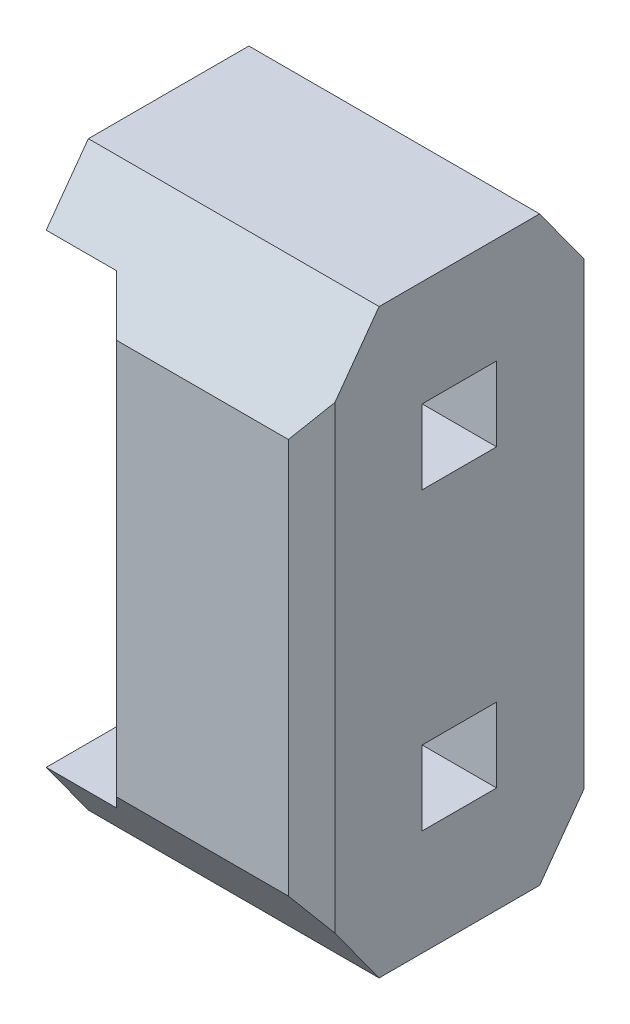
ISO-10303-21;
HEADER;
FILE_DESCRIPTION(('STEP AP214'),'2;1');
FILE_NAME('part.step','',(''),(''),'','','');
FILE_SCHEMA(('AUTOMOTIVE_DESIGN { 1 0 10303 214 1 1 1 1 }'));
ENDSEC;
DATA;
#1=APPLICATION_CONTEXT('core data for automotive mechanical design processes');
#2=APPLICATION_PROTOCOL_DEFINITION('international standard','automotive_design',2000,#1);
#3=PRODUCT_CONTEXT('',#1,'mechanical');
#4=PRODUCT('Part','Part','',(#3));
#5=PRODUCT_RELATED_PRODUCT_CATEGORY('part','',(#4));
#6=PRODUCT_DEFINITION_FORMATION('','',#4);
#7=PRODUCT_DEFINITION_CONTEXT('part definition',#1,'design');
#8=PRODUCT_DEFINITION('design','',#6,#7);
#9=PRODUCT_DEFINITION_SHAPE('','',#8);
#10=(LENGTH_UNIT() NAMED_UNIT(*) SI_UNIT(.MILLI.,.METRE.));
#11=(NAMED_UNIT(*) PLANE_ANGLE_UNIT() SI_UNIT($,.RADIAN.));
#12=(NAMED_UNIT(*) SI_UNIT($,.STERADIAN.) SOLID_ANGLE_UNIT());
#13=UNCERTAINTY_MEASURE_WITH_UNIT(LENGTH_MEASURE(1.E-05),#10,'distance_accuracy_value','');
#14=(GEOMETRIC_REPRESENTATION_CONTEXT(3) GLOBAL_UNCERTAINTY_ASSIGNED_CONTEXT((#13)) GLOBAL_UNIT_ASSIGNED_CONTEXT((#10,
#11,#12)) REPRESENTATION_CONTEXT('',''));
#15=CARTESIAN_POINT('',(0.,0.,0.));
#16=DIRECTION('',(0.,0.,1.));
#17=DIRECTION('',(1.,0.,0.));
#18=AXIS2_PLACEMENT_3D('',#15,#16,#17);
#19=CARTESIAN_POINT('',(1.25,4.6,-10.45));
#20=DIRECTION('',(0.,0.586967571460905,0.809610443394407));
#21=DIRECTION('',(0.,-0.809610443394407,0.586967571460905));
#22=AXIS2_PLACEMENT_3D('',#19,#20,#21);
#23=PLANE('',#22);
#24=DIRECTION('',(1.,0.,0.));
#25=VECTOR('',#24,1.);
#26=CARTESIAN_POINT('',(1.25,4.5,-10.3775));
#27=LINE('',#26,#25);
#28=CARTESIAN_POINT('',(0.,4.5,-10.3775));
#29=VERTEX_POINT('',#28);
#30=CARTESIAN_POINT('',(0.602500000000325,4.5,-10.3775000000001));
#31=VERTEX_POINT('',#30);
#32=EDGE_CURVE('E199',#29,#31,#27,.T.);
#33=ORIENTED_EDGE('',*,*,#32,.T.);
#34=DIRECTION('',(0.506207656348696,-0.698217457033982,0.506207656349605));
#35=VECTOR('',#34,1.);
#36=CARTESIAN_POINT('',(0.6025000000002,4.5,-10.3775));
#37=LINE('',#36,#35);
#38=CARTESIAN_POINT('',(0.819999999999671,4.2,-10.1599999999999));
#39=VERTEX_POINT('',#38);
#40=EDGE_CURVE('E197',#31,#39,#37,.T.);
#41=ORIENTED_EDGE('',*,*,#40,.T.);
#42=DIRECTION('',(1.,0.,0.));
#43=VECTOR('',#42,1.);
#44=CARTESIAN_POINT('',(1.25,4.19999999999999,-10.16));
#45=LINE('',#44,#43);
#46=CARTESIAN_POINT('',(2.30000000000012,4.2,-10.1599999999999));
#47=VERTEX_POINT('',#46);
#48=EDGE_CURVE('E20',#39,#47,#45,.T.);
#49=ORIENTED_EDGE('',*,*,#48,.T.);
#50=DIRECTION('',(0.506207656348957,0.698217457033858,-0.506207656349515));
#51=VECTOR('',#50,1.);
#52=CARTESIAN_POINT('',(2.3,4.19999999999999,-10.16));
#53=LINE('',#52,#51);
#54=CARTESIAN_POINT('',(2.49999999999988,4.47586206896591,-10.3600000000002));
#55=VERTEX_POINT('',#54);
#56=EDGE_CURVE('E181',#47,#55,#53,.T.);
#57=ORIENTED_EDGE('',*,*,#56,.T.);
#58=DIRECTION('',(0.,-0.809610443394407,0.586967571460905));
#59=VECTOR('',#58,1.);
#60=CARTESIAN_POINT('',(2.5,4.6,-10.45));
#61=LINE('',#60,#59);
#62=CARTESIAN_POINT('',(2.5,5.00000000000001,-10.74));
#63=VERTEX_POINT('',#62);
#64=EDGE_CURVE('E188',#55,#63,#61,.F.);
#65=ORIENTED_EDGE('',*,*,#64,.T.);
#66=DIRECTION('',(1.,0.,0.));
#67=VECTOR('',#66,1.);
#68=CARTESIAN_POINT('',(1.25,5.,-10.74));
#69=LINE('',#68,#67);
#70=CARTESIAN_POINT('',(0.,5.00000000000001,-10.74));
#71=VERTEX_POINT('',#70);
#72=EDGE_CURVE('E215',#71,#63,#69,.T.);
#73=ORIENTED_EDGE('',*,*,#72,.F.);
#74=DIRECTION('',(0.,-0.809610443394407,0.586967571460905));
#75=VECTOR('',#74,1.);
#76=CARTESIAN_POINT('',(0.,4.6,-10.45));
#77=LINE('',#76,#75);
#78=EDGE_CURVE('E207',#71,#29,#77,.T.);
#79=ORIENTED_EDGE('',*,*,#78,.T.);
#80=EDGE_LOOP('',(#33,#41,#49,#57,#65,#73,#79));
#81=FACE_BOUND('',#80,.T.);
#82=ADVANCED_FACE('F17',(#81),#23,.T.);
#83=CARTESIAN_POINT('',(1.25,4.6,-12.41));
#84=DIRECTION('',(0.,-0.586967571460905,0.809610443394407));
#85=DIRECTION('',(0.,-0.809610443394407,-0.586967571460905));
#86=AXIS2_PLACEMENT_3D('',#83,#84,#85);
#87=PLANE('',#86);
#88=DIRECTION('',(0.,-0.809610443394407,-0.586967571460905));
#89=VECTOR('',#88,1.);
#90=CARTESIAN_POINT('',(0.,4.6,-12.41));
#91=LINE('',#90,#89);
#92=CARTESIAN_POINT('',(0.,5.00000000000001,-12.12));
#93=VERTEX_POINT('',#92);
#94=CARTESIAN_POINT('',(0.,4.5,-12.4825));
#95=VERTEX_POINT('',#94);
#96=EDGE_CURVE('E263',#93,#95,#91,.T.);
#97=ORIENTED_EDGE('',*,*,#96,.F.);
#98=DIRECTION('',(1.,0.,0.));
#99=VECTOR('',#98,1.);
#100=CARTESIAN_POINT('',(1.25,5.,-12.12));
#101=LINE('',#100,#99);
#102=CARTESIAN_POINT('',(2.5,5.,-12.12));
#103=VERTEX_POINT('',#102);
#104=EDGE_CURVE('E227',#103,#93,#101,.F.);
#105=ORIENTED_EDGE('',*,*,#104,.F.);
#106=DIRECTION('',(0.,-0.809610443394407,-0.586967571460905));
#107=VECTOR('',#106,1.);
#108=CARTESIAN_POINT('',(2.5,4.6,-12.41));
#109=LINE('',#108,#107);
#110=CARTESIAN_POINT('',(2.49999999999988,4.47586206896591,-12.4999999999998));
#111=VERTEX_POINT('',#110);
#112=EDGE_CURVE('E223',#111,#103,#109,.F.);
#113=ORIENTED_EDGE('',*,*,#112,.F.);
#114=DIRECTION('',(0.506207656348957,0.698217457033858,0.506207656349515));
#115=VECTOR('',#114,1.);
#116=CARTESIAN_POINT('',(2.3,4.19999999999999,-12.7));
#117=LINE('',#116,#115);
#118=CARTESIAN_POINT('',(2.30000000000012,4.2,-12.7000000000001));
#119=VERTEX_POINT('',#118);
#120=EDGE_CURVE('E266',#119,#111,#117,.T.);
#121=ORIENTED_EDGE('',*,*,#120,.F.);
#122=DIRECTION('',(1.,0.,0.));
#123=VECTOR('',#122,1.);
#124=CARTESIAN_POINT('',(1.25,4.19999999999999,-12.7));
#125=LINE('',#124,#123);
#126=CARTESIAN_POINT('',(0.819999999999671,4.2,-12.7000000000001));
#127=VERTEX_POINT('',#126);
#128=EDGE_CURVE('E205',#127,#119,#125,.T.);
#129=ORIENTED_EDGE('',*,*,#128,.F.);
#130=DIRECTION('',(0.506207656348696,-0.698217457033982,-0.506207656349605));
#131=VECTOR('',#130,1.);
#132=CARTESIAN_POINT('',(0.6025000000002,4.5,-12.4825));
#133=LINE('',#132,#131);
#134=CARTESIAN_POINT('',(0.602500000000325,4.5,-12.4824999999999));
#135=VERTEX_POINT('',#134);
#136=EDGE_CURVE('E203',#135,#127,#133,.T.);
#137=ORIENTED_EDGE('',*,*,#136,.F.);
#138=DIRECTION('',(1.,0.,0.));
#139=VECTOR('',#138,1.);
#140=CARTESIAN_POINT('',(1.25,4.5,-12.4825));
#141=LINE('',#140,#139);
#142=EDGE_CURVE('E261',#95,#135,#141,.T.);
#143=ORIENTED_EDGE('',*,*,#142,.F.);
#144=EDGE_LOOP('',(#97,#105,#113,#121,#129,#137,#143));
#145=FACE_BOUND('',#144,.T.);
#146=ADVANCED_FACE('F285',(#145),#87,.F.);
#147=CARTESIAN_POINT('',(1.25,0.4,-12.41));
#148=DIRECTION('',(0.,0.586967571460905,0.809610443394407));
#149=DIRECTION('',(0.,-0.809610443394407,0.586967571460905));
#150=AXIS2_PLACEMENT_3D('',#147,#148,#149);
#151=PLANE('',#150);
#152=DIRECTION('',(-0.506207656349403,0.698217457033647,-0.50620765634936));
#153=VECTOR('',#152,1.);
#154=CARTESIAN_POINT('',(2.5,0.524137931034496,-12.5));
#155=LINE('',#154,#153);
#156=CARTESIAN_POINT('',(2.49999999999988,0.524137931034498,-12.4999999999999));
#157=VERTEX_POINT('',#156);
#158=CARTESIAN_POINT('',(2.30000000000012,0.800000000000004,-12.7000000000001));
#159=VERTEX_POINT('',#158);
#160=EDGE_CURVE('E251',#157,#159,#155,.T.);
#161=ORIENTED_EDGE('',*,*,#160,.F.);
#162=DIRECTION('',(0.,-0.809610443394407,0.586967571460905));
#163=VECTOR('',#162,1.);
#164=CARTESIAN_POINT('',(2.5,0.4,-12.41));
#165=LINE('',#164,#163);
#166=CARTESIAN_POINT('',(2.5,0.,-12.12));
#167=VERTEX_POINT('',#166);
#168=EDGE_CURVE('E253',#167,#157,#165,.F.);
#169=ORIENTED_EDGE('',*,*,#168,.F.);
#170=DIRECTION('',(1.,0.,0.));
#171=VECTOR('',#170,1.);
#172=CARTESIAN_POINT('',(1.25,0.,-12.12));
#173=LINE('',#172,#171);
#174=CARTESIAN_POINT('',(0.,0.,-12.12));
#175=VERTEX_POINT('',#174);
#176=EDGE_CURVE('E288',#167,#175,#173,.F.);
#177=ORIENTED_EDGE('',*,*,#176,.T.);
#178=DIRECTION('',(0.,-0.809610443394407,0.586967571460905));
#179=VECTOR('',#178,1.);
#180=CARTESIAN_POINT('',(0.,0.4,-12.41));
#181=LINE('',#180,#179);
#182=CARTESIAN_POINT('',(0.,0.500000000000001,-12.4825));
#183=VERTEX_POINT('',#182);
#184=EDGE_CURVE('E255',#183,#175,#181,.T.);
#185=ORIENTED_EDGE('',*,*,#184,.F.);
#186=DIRECTION('',(1.,0.,0.));
#187=VECTOR('',#186,1.);
#188=CARTESIAN_POINT('',(1.25,0.500000000000002,-12.4825));
#189=LINE('',#188,#187);
#190=CARTESIAN_POINT('',(0.602500000000325,0.500000000000001,-12.4824999999999));
#191=VERTEX_POINT('',#190);
#192=EDGE_CURVE('E257',#191,#183,#189,.F.);
#193=ORIENTED_EDGE('',*,*,#192,.F.);
#194=DIRECTION('',(-0.506207656348696,-0.698217457033983,0.506207656349604));
#195=VECTOR('',#194,1.);
#196=CARTESIAN_POINT('',(0.8199999999998,0.800000000000009,-12.7));
#197=LINE('',#196,#195);
#198=CARTESIAN_POINT('',(0.819999999999671,0.800000000000004,-12.7000000000001));
#199=VERTEX_POINT('',#198);
#200=EDGE_CURVE('E259',#199,#191,#197,.T.);
#201=ORIENTED_EDGE('',*,*,#200,.F.);
#202=DIRECTION('',(1.,0.,0.));
#203=VECTOR('',#202,1.);
#204=CARTESIAN_POINT('',(1.25,0.800000000000009,-12.7));
#205=LINE('',#204,#203);
#206=EDGE_CURVE('E249',#159,#199,#205,.F.);
#207=ORIENTED_EDGE('',*,*,#206,.F.);
#208=EDGE_LOOP('',(#161,#169,#177,#185,#193,#201,#207));
#209=FACE_BOUND('',#208,.T.);
#210=ADVANCED_FACE('F431',(#209),#151,.F.);
#211=CARTESIAN_POINT('',(1.25,0.4,-10.45));
#212=DIRECTION('',(0.,-0.586967571460905,0.809610443394407));
#213=DIRECTION('',(0.,-0.809610443394407,-0.586967571460905));
#214=AXIS2_PLACEMENT_3D('',#211,#212,#213);
#215=PLANE('',#214);
#216=DIRECTION('',(1.,0.,0.));
#217=VECTOR('',#216,1.);
#218=CARTESIAN_POINT('',(1.25,0.800000000000009,-10.16));
#219=LINE('',#218,#217);
#220=CARTESIAN_POINT('',(2.30000000000012,0.800000000000004,-10.1599999999999));
#221=VERTEX_POINT('',#220);
#222=CARTESIAN_POINT('',(0.819999999999671,0.800000000000005,-10.1599999999999));
#223=VERTEX_POINT('',#222);
#224=EDGE_CURVE('E191',#221,#223,#219,.F.);
#225=ORIENTED_EDGE('',*,*,#224,.T.);
#226=DIRECTION('',(-0.506207656348696,-0.698217457033983,-0.506207656349604));
#227=VECTOR('',#226,1.);
#228=CARTESIAN_POINT('',(0.8199999999998,0.800000000000009,-10.16));
#229=LINE('',#228,#227);
#230=CARTESIAN_POINT('',(0.602500000000325,0.500000000000001,-10.3775000000001));
#231=VERTEX_POINT('',#230);
#232=EDGE_CURVE('E232',#223,#231,#229,.T.);
#233=ORIENTED_EDGE('',*,*,#232,.T.);
#234=DIRECTION('',(1.,0.,0.));
#235=VECTOR('',#234,1.);
#236=CARTESIAN_POINT('',(1.25,0.500000000000002,-10.3775));
#237=LINE('',#236,#235);
#238=CARTESIAN_POINT('',(0.,0.500000000000001,-10.3775));
#239=VERTEX_POINT('',#238);
#240=EDGE_CURVE('E246',#231,#239,#237,.F.);
#241=ORIENTED_EDGE('',*,*,#240,.T.);
#242=DIRECTION('',(0.,-0.809610443394407,-0.586967571460905));
#243=VECTOR('',#242,1.);
#244=CARTESIAN_POINT('',(0.,0.4,-10.45));
#245=LINE('',#244,#243);
#246=CARTESIAN_POINT('',(0.,0.,-10.74));
#247=VERTEX_POINT('',#246);
#248=EDGE_CURVE('E244',#239,#247,#245,.T.);
#249=ORIENTED_EDGE('',*,*,#248,.T.);
#250=DIRECTION('',(1.,0.,0.));
#251=VECTOR('',#250,1.);
#252=CARTESIAN_POINT('',(1.25,0.,-10.74));
#253=LINE('',#252,#251);
#254=CARTESIAN_POINT('',(2.5,0.,-10.74));
#255=VERTEX_POINT('',#254);
#256=EDGE_CURVE('E293',#247,#255,#253,.T.);
#257=ORIENTED_EDGE('',*,*,#256,.T.);
#258=DIRECTION('',(0.,-0.809610443394407,-0.586967571460905));
#259=VECTOR('',#258,1.);
#260=CARTESIAN_POINT('',(2.5,0.4,-10.45));
#261=LINE('',#260,#259);
#262=CARTESIAN_POINT('',(2.49999999999988,0.524137931034498,-10.3600000000001));
#263=VERTEX_POINT('',#262);
#264=EDGE_CURVE('E241',#255,#263,#261,.F.);
#265=ORIENTED_EDGE('',*,*,#264,.T.);
#266=DIRECTION('',(-0.506207656349403,0.698217457033647,0.50620765634936));
#267=VECTOR('',#266,1.);
#268=CARTESIAN_POINT('',(2.5,0.524137931034496,-10.36));
#269=LINE('',#268,#267);
#270=EDGE_CURVE('E239',#263,#221,#269,.T.);
#271=ORIENTED_EDGE('',*,*,#270,.T.);
#272=EDGE_LOOP('',(#225,#233,#241,#249,#257,#265,#271));
#273=FACE_BOUND('',#272,.T.);
#274=ADVANCED_FACE('F421',(#273),#215,.T.);
#275=CARTESIAN_POINT('',(1.25,5.,-11.43));
#276=DIRECTION('',(0.,1.,0.));
#277=DIRECTION('',(0.,0.,1.));
#278=AXIS2_PLACEMENT_3D('',#275,#276,#277);
#279=PLANE('',#278);
#280=ORIENTED_EDGE('',*,*,#104,.T.);
#281=DIRECTION('',(0.,0.,-1.));
#282=VECTOR('',#281,1.);
#283=CARTESIAN_POINT('',(0.,5.,-11.43));
#284=LINE('',#283,#282);
#285=EDGE_CURVE('E231',#93,#71,#284,.F.);
#286=ORIENTED_EDGE('',*,*,#285,.T.);
#287=ORIENTED_EDGE('',*,*,#72,.T.);
#288=DIRECTION('',(0.,0.,1.));
#289=VECTOR('',#288,1.);
#290=CARTESIAN_POINT('',(2.5,5.,-11.43));
#291=LINE('',#290,#289);
#292=EDGE_CURVE('E219',#63,#103,#291,.F.);
#293=ORIENTED_EDGE('',*,*,#292,.T.);
#294=EDGE_LOOP('',(#280,#286,#287,#293));
#295=FACE_BOUND('',#294,.T.);
#296=ADVANCED_FACE('F229',(#295),#279,.T.);
#297=CARTESIAN_POINT('',(1.25,0.,-11.43));
#298=DIRECTION('',(0.,1.,0.));
#299=DIRECTION('',(0.,0.,1.));
#300=AXIS2_PLACEMENT_3D('',#297,#298,#299);
#301=PLANE('',#300);
#302=DIRECTION('',(0.,0.,-1.));
#303=VECTOR('',#302,1.);
#304=CARTESIAN_POINT('',(0.,0.,-11.43));
#305=LINE('',#304,#303);
#306=EDGE_CURVE('E297',#247,#175,#305,.T.);
#307=ORIENTED_EDGE('',*,*,#306,.T.);
#308=ORIENTED_EDGE('',*,*,#176,.F.);
#309=DIRECTION('',(0.,0.,1.));
#310=VECTOR('',#309,1.);
#311=CARTESIAN_POINT('',(2.5,0.,-11.43));
#312=LINE('',#311,#310);
#313=EDGE_CURVE('E287',#255,#167,#312,.F.);
#314=ORIENTED_EDGE('',*,*,#313,.F.);
#315=ORIENTED_EDGE('',*,*,#256,.F.);
#316=EDGE_LOOP('',(#307,#308,#314,#315));
#317=FACE_BOUND('',#316,.T.);
#318=ADVANCED_FACE('F428',(#317),#301,.F.);
#319=CARTESIAN_POINT('',(0.,4.75,-11.43));
#320=DIRECTION('',(1.,0.,0.));
#321=DIRECTION('',(0.,0.,-1.));
#322=AXIS2_PLACEMENT_3D('',#319,#320,#321);
#323=PLANE('',#322);
#324=ORIENTED_EDGE('',*,*,#285,.F.);
#325=ORIENTED_EDGE('',*,*,#96,.T.);
#326=DIRECTION('',(0.,0.,1.));
#327=VECTOR('',#326,1.);
#328=CARTESIAN_POINT('',(0.,4.5,-11.43));
#329=LINE('',#328,#327);
#330=EDGE_CURVE('E307',#95,#29,#329,.T.);
#331=ORIENTED_EDGE('',*,*,#330,.T.);
#332=ORIENTED_EDGE('',*,*,#78,.F.);
#333=EDGE_LOOP('',(#324,#325,#331,#332));
#334=FACE_BOUND('',#333,.T.);
#335=ADVANCED_FACE('F441',(#334),#323,.F.);
#336=CARTESIAN_POINT('',(0.,0.25,-11.43));
#337=DIRECTION('',(1.,0.,0.));
#338=DIRECTION('',(0.,0.,-1.));
#339=AXIS2_PLACEMENT_3D('',#336,#337,#338);
#340=PLANE('',#339);
#341=ORIENTED_EDGE('',*,*,#306,.F.);
#342=ORIENTED_EDGE('',*,*,#248,.F.);
#343=DIRECTION('',(0.,0.,1.));
#344=VECTOR('',#343,1.);
#345=CARTESIAN_POINT('',(0.,0.5,-11.43));
#346=LINE('',#345,#344);
#347=EDGE_CURVE('E315',#183,#239,#346,.T.);
#348=ORIENTED_EDGE('',*,*,#347,.F.);
#349=ORIENTED_EDGE('',*,*,#184,.T.);
#350=EDGE_LOOP('',(#341,#342,#348,#349));
#351=FACE_BOUND('',#350,.T.);
#352=ADVANCED_FACE('F443',(#351),#340,.F.);
#353=CARTESIAN_POINT('',(1.55,3.45,-11.43));
#354=DIRECTION('',(0.,1.,0.));
#355=DIRECTION('',(0.,0.,1.));
#356=AXIS2_PLACEMENT_3D('',#353,#354,#355);
#357=PLANE('',#356);
#358=DIRECTION('',(1.,0.,0.));
#359=VECTOR('',#358,1.);
#360=CARTESIAN_POINT('',(1.55,3.45,-11.75));
#361=LINE('',#360,#359);
#362=CARTESIAN_POINT('',(0.6,3.45,-11.75));
#363=VERTEX_POINT('',#362);
#364=CARTESIAN_POINT('',(2.5,3.45,-11.75));
#365=VERTEX_POINT('',#364);
#366=EDGE_CURVE('E332',#363,#365,#361,.T.);
#367=ORIENTED_EDGE('',*,*,#366,.F.);
#368=DIRECTION('',(0.,0.,1.));
#369=VECTOR('',#368,1.);
#370=CARTESIAN_POINT('',(0.6,3.45,-11.43));
#371=LINE('',#370,#369);
#372=CARTESIAN_POINT('',(0.6,3.45,-11.11));
#373=VERTEX_POINT('',#372);
#374=EDGE_CURVE('E302',#363,#373,#371,.T.);
#375=ORIENTED_EDGE('',*,*,#374,.T.);
#376=DIRECTION('',(1.,0.,0.));
#377=VECTOR('',#376,1.);
#378=CARTESIAN_POINT('',(1.55,3.45,-11.11));
#379=LINE('',#378,#377);
#380=CARTESIAN_POINT('',(2.5,3.45,-11.11));
#381=VERTEX_POINT('',#380);
#382=EDGE_CURVE('E327',#373,#381,#379,.T.);
#383=ORIENTED_EDGE('',*,*,#382,.T.);
#384=DIRECTION('',(0.,0.,1.));
#385=VECTOR('',#384,1.);
#386=CARTESIAN_POINT('',(2.5,3.45,-11.43));
#387=LINE('',#386,#385);
#388=EDGE_CURVE('E300',#381,#365,#387,.F.);
#389=ORIENTED_EDGE('',*,*,#388,.T.);
#390=EDGE_LOOP('',(#367,#375,#383,#389));
#391=FACE_BOUND('',#390,.T.);
#392=ADVANCED_FACE('F398',(#391),#357,.T.);
#393=CARTESIAN_POINT('',(0.71,2.5,-12.59));
#394=DIRECTION('',(0.707106781190498,0.,0.707106781182598));
#395=DIRECTION('',(0.707106781182598,0.,-0.707106781190498));
#396=AXIS2_PLACEMENT_3D('',#393,#394,#395);
#397=PLANE('',#396);
#398=ORIENTED_EDGE('',*,*,#200,.T.);
#399=DIRECTION('',(0.70710678118667,0.,-0.707106781186425));
#400=VECTOR('',#399,1.);
#401=CARTESIAN_POINT('',(0.6000000000002,0.5,-12.48));
#402=LINE('',#401,#400);
#403=CARTESIAN_POINT('',(0.600000000000408,0.5,-12.4799999999997));
#404=VERTEX_POINT('',#403);
#405=EDGE_CURVE('E312',#404,#191,#402,.T.);
#406=ORIENTED_EDGE('',*,*,#405,.F.);
#407=DIRECTION('',(0.,1.,0.));
#408=VECTOR('',#407,1.);
#409=CARTESIAN_POINT('',(0.6,2.5,-12.48));
#410=LINE('',#409,#408);
#411=CARTESIAN_POINT('',(0.600000000000408,4.5,-12.4799999999997));
#412=VERTEX_POINT('',#411);
#413=EDGE_CURVE('E337',#404,#412,#410,.T.);
#414=ORIENTED_EDGE('',*,*,#413,.T.);
#415=DIRECTION('',(0.70710678118667,0.,-0.707106781186425));
#416=VECTOR('',#415,1.);
#417=CARTESIAN_POINT('',(0.6000000000002,4.5,-12.48));
#418=LINE('',#417,#416);
#419=EDGE_CURVE('E304',#412,#135,#418,.T.);
#420=ORIENTED_EDGE('',*,*,#419,.T.);
#421=ORIENTED_EDGE('',*,*,#136,.T.);
#422=DIRECTION('',(0.,1.,0.));
#423=VECTOR('',#422,1.);
#424=CARTESIAN_POINT('',(0.8199999999998,2.5,-12.7));
#425=LINE('',#424,#423);
#426=EDGE_CURVE('E275',#127,#199,#425,.F.);
#427=ORIENTED_EDGE('',*,*,#426,.T.);
#428=EDGE_LOOP('',(#398,#406,#414,#420,#421,#427));
#429=FACE_BOUND('',#428,.T.);
#430=ADVANCED_FACE('F435',(#429),#397,.F.);
#431=CARTESIAN_POINT('',(0.30125,4.5,-11.43));
#432=DIRECTION('',(0.,1.,0.));
#433=DIRECTION('',(0.,0.,1.));
#434=AXIS2_PLACEMENT_3D('',#431,#432,#433);
#435=PLANE('',#434);
#436=ORIENTED_EDGE('',*,*,#142,.T.);
#437=ORIENTED_EDGE('',*,*,#419,.F.);
#438=DIRECTION('',(0.,0.,-1.));
#439=VECTOR('',#438,1.);
#440=CARTESIAN_POINT('',(0.6,4.5,-11.43));
#441=LINE('',#440,#439);
#442=CARTESIAN_POINT('',(0.600000000000279,4.5,-10.3800000000001));
#443=VERTEX_POINT('',#442);
#444=EDGE_CURVE('E339',#412,#443,#441,.F.);
#445=ORIENTED_EDGE('',*,*,#444,.T.);
#446=DIRECTION('',(-0.707106781182598,0.,-0.707106781190498));
#447=VECTOR('',#446,1.);
#448=CARTESIAN_POINT('',(0.71,4.5,-10.27));
#449=LINE('',#448,#447);
#450=EDGE_CURVE('E310',#443,#31,#449,.F.);
#451=ORIENTED_EDGE('',*,*,#450,.T.);
#452=ORIENTED_EDGE('',*,*,#32,.F.);
#453=ORIENTED_EDGE('',*,*,#330,.F.);
#454=EDGE_LOOP('',(#436,#437,#445,#451,#452,#453));
#455=FACE_BOUND('',#454,.T.);
#456=ADVANCED_FACE('F439',(#455),#435,.F.);
#457=CARTESIAN_POINT('',(0.71,2.5,-10.27));
#458=DIRECTION('',(0.707106781190498,0.,-0.707106781182598));
#459=DIRECTION('',(-0.707106781182598,0.,-0.707106781190498));
#460=AXIS2_PLACEMENT_3D('',#457,#458,#459);
#461=PLANE('',#460);
#462=ORIENTED_EDGE('',*,*,#232,.F.);
#463=DIRECTION('',(0.,1.,0.));
#464=VECTOR('',#463,1.);
#465=CARTESIAN_POINT('',(0.8199999999998,2.5,-10.16));
#466=LINE('',#465,#464);
#467=EDGE_CURVE('E325',#39,#223,#466,.F.);
#468=ORIENTED_EDGE('',*,*,#467,.F.);
#469=ORIENTED_EDGE('',*,*,#40,.F.);
#470=ORIENTED_EDGE('',*,*,#450,.F.);
#471=DIRECTION('',(0.,1.,0.));
#472=VECTOR('',#471,1.);
#473=CARTESIAN_POINT('',(0.6,2.5,-10.38));
#474=LINE('',#473,#472);
#475=CARTESIAN_POINT('',(0.600000000000407,0.5,-10.3800000000003));
#476=VERTEX_POINT('',#475);
#477=EDGE_CURVE('E341',#443,#476,#474,.F.);
#478=ORIENTED_EDGE('',*,*,#477,.T.);
#479=DIRECTION('',(-0.707106781186425,0.,-0.70710678118667));
#480=VECTOR('',#479,1.);
#481=CARTESIAN_POINT('',(0.6025000000002,0.5,-10.3775));
#482=LINE('',#481,#480);
#483=EDGE_CURVE('E318',#231,#476,#482,.T.);
#484=ORIENTED_EDGE('',*,*,#483,.F.);
#485=EDGE_LOOP('',(#462,#468,#469,#470,#478,#484));
#486=FACE_BOUND('',#485,.T.);
#487=ADVANCED_FACE('F416',(#486),#461,.F.);
#488=CARTESIAN_POINT('',(0.30125,0.5,-11.43));
#489=DIRECTION('',(0.,1.,0.));
#490=DIRECTION('',(0.,0.,1.));
#491=AXIS2_PLACEMENT_3D('',#488,#489,#490);
#492=PLANE('',#491);
#493=ORIENTED_EDGE('',*,*,#483,.T.);
#494=DIRECTION('',(0.,0.,-1.));
#495=VECTOR('',#494,1.);
#496=CARTESIAN_POINT('',(0.6,0.5,-11.43));
#497=LINE('',#496,#495);
#498=EDGE_CURVE('E343',#476,#404,#497,.T.);
#499=ORIENTED_EDGE('',*,*,#498,.T.);
#500=ORIENTED_EDGE('',*,*,#405,.T.);
#501=ORIENTED_EDGE('',*,*,#192,.T.);
#502=ORIENTED_EDGE('',*,*,#347,.T.);
#503=ORIENTED_EDGE('',*,*,#240,.F.);
#504=EDGE_LOOP('',(#493,#499,#500,#501,#502,#503));
#505=FACE_BOUND('',#504,.T.);
#506=ADVANCED_FACE('F418',(#505),#492,.T.);
#507=CARTESIAN_POINT('',(1.55,1.23,-11.75));
#508=DIRECTION('',(0.,0.,1.));
#509=DIRECTION('',(1.,0.,0.));
#510=AXIS2_PLACEMENT_3D('',#507,#508,#509);
#511=PLANE('',#510);
#512=DIRECTION('',(1.,0.,0.));
#513=VECTOR('',#512,1.);
#514=CARTESIAN_POINT('',(1.55,1.55,-11.75));
#515=LINE('',#514,#513);
#516=CARTESIAN_POINT('',(2.5,1.55,-11.75));
#517=VERTEX_POINT('',#516);
#518=CARTESIAN_POINT('',(0.6,1.55,-11.75));
#519=VERTEX_POINT('',#518);
#520=EDGE_CURVE('E283',#517,#519,#515,.F.);
#521=ORIENTED_EDGE('',*,*,#520,.T.);
#522=DIRECTION('',(0.,1.,0.));
#523=VECTOR('',#522,1.);
#524=CARTESIAN_POINT('',(0.6,2.5,-11.75));
#525=LINE('',#524,#523);
#526=CARTESIAN_POINT('',(0.6,0.91,-11.75));
#527=VERTEX_POINT('',#526);
#528=EDGE_CURVE('E346',#519,#527,#525,.F.);
#529=ORIENTED_EDGE('',*,*,#528,.T.);
#530=DIRECTION('',(1.,0.,0.));
#531=VECTOR('',#530,1.);
#532=CARTESIAN_POINT('',(1.55,0.91,-11.75));
#533=LINE('',#532,#531);
#534=CARTESIAN_POINT('',(2.5,0.91,-11.75));
#535=VERTEX_POINT('',#534);
#536=EDGE_CURVE('E354',#535,#527,#533,.F.);
#537=ORIENTED_EDGE('',*,*,#536,.F.);
#538=DIRECTION('',(0.,1.,0.));
#539=VECTOR('',#538,1.);
#540=CARTESIAN_POINT('',(2.5,1.23,-11.75));
#541=LINE('',#540,#539);
#542=EDGE_CURVE('E321',#535,#517,#541,.T.);
#543=ORIENTED_EDGE('',*,*,#542,.T.);
#544=EDGE_LOOP('',(#521,#529,#537,#543));
#545=FACE_BOUND('',#544,.T.);
#546=ADVANCED_FACE('F483',(#545),#511,.T.);
#547=CARTESIAN_POINT('',(1.56,2.5,-12.7));
#548=DIRECTION('',(0.,0.,1.));
#549=DIRECTION('',(1.,0.,0.));
#550=AXIS2_PLACEMENT_3D('',#547,#548,#549);
#551=PLANE('',#550);
#552=DIRECTION('',(0.,1.,0.));
#553=VECTOR('',#552,1.);
#554=CARTESIAN_POINT('',(2.30000000000047,2.5,-12.7000000000005));
#555=LINE('',#554,#553);
#556=EDGE_CURVE('E193',#159,#119,#555,.T.);
#557=ORIENTED_EDGE('',*,*,#556,.F.);
#558=ORIENTED_EDGE('',*,*,#206,.T.);
#559=ORIENTED_EDGE('',*,*,#426,.F.);
#560=ORIENTED_EDGE('',*,*,#128,.T.);
#561=EDGE_LOOP('',(#557,#558,#559,#560));
#562=FACE_BOUND('',#561,.T.);
#563=ADVANCED_FACE('F272',(#562),#551,.F.);
#564=CARTESIAN_POINT('',(1.56,2.5,-10.16));
#565=DIRECTION('',(0.,0.,1.));
#566=DIRECTION('',(1.,0.,0.));
#567=AXIS2_PLACEMENT_3D('',#564,#565,#566);
#568=PLANE('',#567);
#569=ORIENTED_EDGE('',*,*,#48,.F.);
#570=ORIENTED_EDGE('',*,*,#467,.T.);
#571=ORIENTED_EDGE('',*,*,#224,.F.);
#572=DIRECTION('',(0.,1.,0.));
#573=VECTOR('',#572,1.);
#574=CARTESIAN_POINT('',(2.30000000000047,2.5,-10.1599999999995));
#575=LINE('',#574,#573);
#576=EDGE_CURVE('E183',#47,#221,#575,.F.);
#577=ORIENTED_EDGE('',*,*,#576,.F.);
#578=EDGE_LOOP('',(#569,#570,#571,#577));
#579=FACE_BOUND('',#578,.T.);
#580=ADVANCED_FACE('F189',(#579),#568,.T.);
#581=CARTESIAN_POINT('',(1.55,3.77,-11.11));
#582=DIRECTION('',(0.,0.,1.));
#583=DIRECTION('',(1.,0.,0.));
#584=AXIS2_PLACEMENT_3D('',#581,#582,#583);
#585=PLANE('',#584);
#586=DIRECTION('',(0.,1.,0.));
#587=VECTOR('',#586,1.);
#588=CARTESIAN_POINT('',(2.5,3.77,-11.11));
#589=LINE('',#588,#587);
#590=CARTESIAN_POINT('',(2.5,4.09,-11.11));
#591=VERTEX_POINT('',#590);
#592=EDGE_CURVE('E330',#381,#591,#589,.T.);
#593=ORIENTED_EDGE('',*,*,#592,.F.);
#594=ORIENTED_EDGE('',*,*,#382,.F.);
#595=DIRECTION('',(0.,1.,0.));
#596=VECTOR('',#595,1.);
#597=CARTESIAN_POINT('',(0.6,2.5,-11.11));
#598=LINE('',#597,#596);
#599=CARTESIAN_POINT('',(0.6,4.09,-11.11));
#600=VERTEX_POINT('',#599);
#601=EDGE_CURVE('E351',#373,#600,#598,.T.);
#602=ORIENTED_EDGE('',*,*,#601,.T.);
#603=DIRECTION('',(1.,0.,0.));
#604=VECTOR('',#603,1.);
#605=CARTESIAN_POINT('',(1.55,4.09,-11.11));
#606=LINE('',#605,#604);
#607=EDGE_CURVE('E368',#600,#591,#606,.T.);
#608=ORIENTED_EDGE('',*,*,#607,.T.);
#609=EDGE_LOOP('',(#593,#594,#602,#608));
#610=FACE_BOUND('',#609,.T.);
#611=ADVANCED_FACE('F402',(#610),#585,.F.);
#612=CARTESIAN_POINT('',(1.55,3.77,-11.75));
#613=DIRECTION('',(0.,0.,1.));
#614=DIRECTION('',(1.,0.,0.));
#615=AXIS2_PLACEMENT_3D('',#612,#613,#614);
#616=PLANE('',#615);
#617=DIRECTION('',(1.,0.,0.));
#618=VECTOR('',#617,1.);
#619=CARTESIAN_POINT('',(1.55,4.09,-11.75));
#620=LINE('',#619,#618);
#621=CARTESIAN_POINT('',(2.5,4.09,-11.75));
#622=VERTEX_POINT('',#621);
#623=CARTESIAN_POINT('',(0.6,4.09,-11.75));
#624=VERTEX_POINT('',#623);
#625=EDGE_CURVE('E371',#622,#624,#620,.F.);
#626=ORIENTED_EDGE('',*,*,#625,.T.);
#627=DIRECTION('',(0.,1.,0.));
#628=VECTOR('',#627,1.);
#629=CARTESIAN_POINT('',(0.6,2.5,-11.75));
#630=LINE('',#629,#628);
#631=EDGE_CURVE('E348',#624,#363,#630,.F.);
#632=ORIENTED_EDGE('',*,*,#631,.T.);
#633=ORIENTED_EDGE('',*,*,#366,.T.);
#634=DIRECTION('',(0.,1.,0.));
#635=VECTOR('',#634,1.);
#636=CARTESIAN_POINT('',(2.5,3.77,-11.75));
#637=LINE('',#636,#635);
#638=EDGE_CURVE('E335',#365,#622,#637,.T.);
#639=ORIENTED_EDGE('',*,*,#638,.T.);
#640=EDGE_LOOP('',(#626,#632,#633,#639));
#641=FACE_BOUND('',#640,.T.);
#642=ADVANCED_FACE('F395',(#641),#616,.T.);
#643=CARTESIAN_POINT('',(0.6,2.5,-11.43));
#644=DIRECTION('',(1.,0.,0.));
#645=DIRECTION('',(0.,0.,-1.));
#646=AXIS2_PLACEMENT_3D('',#643,#644,#645);
#647=PLANE('',#646);
#648=ORIENTED_EDGE('',*,*,#374,.F.);
#649=ORIENTED_EDGE('',*,*,#631,.F.);
#650=DIRECTION('',(0.,0.,1.));
#651=VECTOR('',#650,1.);
#652=CARTESIAN_POINT('',(0.6,4.09,-11.43));
#653=LINE('',#652,#651);
#654=EDGE_CURVE('E192',#624,#600,#653,.T.);
#655=ORIENTED_EDGE('',*,*,#654,.T.);
#656=ORIENTED_EDGE('',*,*,#601,.F.);
#657=EDGE_LOOP('',(#648,#649,#655,#656));
#658=FACE_BOUND('',#657,.T.);
#659=ORIENTED_EDGE('',*,*,#528,.F.);
#660=DIRECTION('',(0.,0.,1.));
#661=VECTOR('',#660,1.);
#662=CARTESIAN_POINT('',(0.6,1.55,-11.43));
#663=LINE('',#662,#661);
#664=CARTESIAN_POINT('',(0.6,1.55,-11.11));
#665=VERTEX_POINT('',#664);
#666=EDGE_CURVE('E360',#519,#665,#663,.T.);
#667=ORIENTED_EDGE('',*,*,#666,.T.);
#668=DIRECTION('',(0.,1.,0.));
#669=VECTOR('',#668,1.);
#670=CARTESIAN_POINT('',(0.6,1.23,-11.11));
#671=LINE('',#670,#669);
#672=CARTESIAN_POINT('',(0.6,0.91,-11.11));
#673=VERTEX_POINT('',#672);
#674=EDGE_CURVE('E374',#665,#673,#671,.F.);
#675=ORIENTED_EDGE('',*,*,#674,.T.);
#676=DIRECTION('',(0.,0.,1.));
#677=VECTOR('',#676,1.);
#678=CARTESIAN_POINT('',(0.6,0.91,-11.43));
#679=LINE('',#678,#677);
#680=EDGE_CURVE('E357',#527,#673,#679,.T.);
#681=ORIENTED_EDGE('',*,*,#680,.F.);
#682=EDGE_LOOP('',(#659,#667,#675,#681));
#683=FACE_BOUND('',#682,.T.);
#684=ORIENTED_EDGE('',*,*,#477,.F.);
#685=ORIENTED_EDGE('',*,*,#444,.F.);
#686=ORIENTED_EDGE('',*,*,#413,.F.);
#687=ORIENTED_EDGE('',*,*,#498,.F.);
#688=EDGE_LOOP('',(#684,#685,#686,#687));
#689=FACE_BOUND('',#688,.T.);
#690=ADVANCED_FACE('F404',(#658,#683,#689),#647,.F.);
#691=CARTESIAN_POINT('',(1.55,0.91,-11.43));
#692=DIRECTION('',(0.,1.,0.));
#693=DIRECTION('',(0.,0.,1.));
#694=AXIS2_PLACEMENT_3D('',#691,#692,#693);
#695=PLANE('',#694);
#696=ORIENTED_EDGE('',*,*,#536,.T.);
#697=ORIENTED_EDGE('',*,*,#680,.T.);
#698=DIRECTION('',(1.,0.,0.));
#699=VECTOR('',#698,1.);
#700=CARTESIAN_POINT('',(1.55,0.91,-11.11));
#701=LINE('',#700,#699);
#702=CARTESIAN_POINT('',(2.5,0.91,-11.11));
#703=VERTEX_POINT('',#702);
#704=EDGE_CURVE('E376',#673,#703,#701,.T.);
#705=ORIENTED_EDGE('',*,*,#704,.T.);
#706=DIRECTION('',(0.,0.,1.));
#707=VECTOR('',#706,1.);
#708=CARTESIAN_POINT('',(2.5,0.91,-11.43));
#709=LINE('',#708,#707);
#710=EDGE_CURVE('E34',#703,#535,#709,.F.);
#711=ORIENTED_EDGE('',*,*,#710,.T.);
#712=EDGE_LOOP('',(#696,#697,#705,#711));
#713=FACE_BOUND('',#712,.T.);
#714=ADVANCED_FACE('F407',(#713),#695,.T.);
#715=CARTESIAN_POINT('',(1.55,1.55,-11.43));
#716=DIRECTION('',(0.,1.,0.));
#717=DIRECTION('',(0.,0.,1.));
#718=AXIS2_PLACEMENT_3D('',#715,#716,#717);
#719=PLANE('',#718);
#720=DIRECTION('',(0.,0.,1.));
#721=VECTOR('',#720,1.);
#722=CARTESIAN_POINT('',(2.5,1.55,-11.43));
#723=LINE('',#722,#721);
#724=CARTESIAN_POINT('',(2.5,1.55,-11.11));
#725=VERTEX_POINT('',#724);
#726=EDGE_CURVE('E362',#725,#517,#723,.F.);
#727=ORIENTED_EDGE('',*,*,#726,.F.);
#728=DIRECTION('',(1.,0.,0.));
#729=VECTOR('',#728,1.);
#730=CARTESIAN_POINT('',(1.55,1.55,-11.11));
#731=LINE('',#730,#729);
#732=EDGE_CURVE('E378',#725,#665,#731,.F.);
#733=ORIENTED_EDGE('',*,*,#732,.T.);
#734=ORIENTED_EDGE('',*,*,#666,.F.);
#735=ORIENTED_EDGE('',*,*,#520,.F.);
#736=EDGE_LOOP('',(#727,#733,#734,#735));
#737=FACE_BOUND('',#736,.T.);
#738=ADVANCED_FACE('F468',(#737),#719,.F.);
#739=CARTESIAN_POINT('',(2.4,2.5,-12.6));
#740=DIRECTION('',(0.707106781189898,0.,-0.707106781183198));
#741=DIRECTION('',(-0.707106781183198,0.,-0.707106781189898));
#742=AXIS2_PLACEMENT_3D('',#739,#740,#741);
#743=PLANE('',#742);
#744=DIRECTION('',(0.,1.,0.));
#745=VECTOR('',#744,1.);
#746=CARTESIAN_POINT('',(2.5,2.5,-12.5));
#747=LINE('',#746,#745);
#748=EDGE_CURVE('E381',#157,#111,#747,.T.);
#749=ORIENTED_EDGE('',*,*,#748,.F.);
#750=ORIENTED_EDGE('',*,*,#160,.T.);
#751=ORIENTED_EDGE('',*,*,#556,.T.);
#752=ORIENTED_EDGE('',*,*,#120,.T.);
#753=EDGE_LOOP('',(#749,#750,#751,#752));
#754=FACE_BOUND('',#753,.T.);
#755=ADVANCED_FACE('F281',(#754),#743,.T.);
#756=CARTESIAN_POINT('',(2.4,2.5,-10.26));
#757=DIRECTION('',(0.707106781189898,0.,0.707106781183198));
#758=DIRECTION('',(0.707106781183198,0.,-0.707106781189898));
#759=AXIS2_PLACEMENT_3D('',#756,#757,#758);
#760=PLANE('',#759);
#761=DIRECTION('',(0.,1.,0.));
#762=VECTOR('',#761,1.);
#763=CARTESIAN_POINT('',(2.5,2.5,-10.36));
#764=LINE('',#763,#762);
#765=EDGE_CURVE('E186',#55,#263,#764,.F.);
#766=ORIENTED_EDGE('',*,*,#765,.F.);
#767=ORIENTED_EDGE('',*,*,#56,.F.);
#768=ORIENTED_EDGE('',*,*,#576,.T.);
#769=ORIENTED_EDGE('',*,*,#270,.F.);
#770=EDGE_LOOP('',(#766,#767,#768,#769));
#771=FACE_BOUND('',#770,.T.);
#772=ADVANCED_FACE('F182',(#771),#760,.T.);
#773=CARTESIAN_POINT('',(1.55,4.09,-11.43));
#774=DIRECTION('',(0.,1.,0.));
#775=DIRECTION('',(0.,0.,1.));
#776=AXIS2_PLACEMENT_3D('',#773,#774,#775);
#777=PLANE('',#776);
#778=DIRECTION('',(0.,0.,-1.));
#779=VECTOR('',#778,1.);
#780=CARTESIAN_POINT('',(2.5,4.09,-11.43));
#781=LINE('',#780,#779);
#782=EDGE_CURVE('E26',#591,#622,#781,.T.);
#783=ORIENTED_EDGE('',*,*,#782,.F.);
#784=ORIENTED_EDGE('',*,*,#607,.F.);
#785=ORIENTED_EDGE('',*,*,#654,.F.);
#786=ORIENTED_EDGE('',*,*,#625,.F.);
#787=EDGE_LOOP('',(#783,#784,#785,#786));
#788=FACE_BOUND('',#787,.T.);
#789=ADVANCED_FACE('F392',(#788),#777,.F.);
#790=CARTESIAN_POINT('',(1.55,1.23,-11.11));
#791=DIRECTION('',(0.,0.,1.));
#792=DIRECTION('',(1.,0.,0.));
#793=AXIS2_PLACEMENT_3D('',#790,#791,#792);
#794=PLANE('',#793);
#795=DIRECTION('',(0.,1.,0.));
#796=VECTOR('',#795,1.);
#797=CARTESIAN_POINT('',(2.5,2.5,-11.11));
#798=LINE('',#797,#796);
#799=EDGE_CURVE('E11',#703,#725,#798,.T.);
#800=ORIENTED_EDGE('',*,*,#799,.F.);
#801=ORIENTED_EDGE('',*,*,#704,.F.);
#802=ORIENTED_EDGE('',*,*,#674,.F.);
#803=ORIENTED_EDGE('',*,*,#732,.F.);
#804=EDGE_LOOP('',(#800,#801,#802,#803));
#805=FACE_BOUND('',#804,.T.);
#806=ADVANCED_FACE('F454',(#805),#794,.F.);
#807=CARTESIAN_POINT('',(2.5,2.5,-11.43));
#808=DIRECTION('',(1.,0.,0.));
#809=DIRECTION('',(0.,0.,-1.));
#810=AXIS2_PLACEMENT_3D('',#807,#808,#809);
#811=PLANE('',#810);
#812=ORIENTED_EDGE('',*,*,#710,.F.);
#813=ORIENTED_EDGE('',*,*,#799,.T.);
#814=ORIENTED_EDGE('',*,*,#726,.T.);
#815=ORIENTED_EDGE('',*,*,#542,.F.);
#816=EDGE_LOOP('',(#812,#813,#814,#815));
#817=FACE_BOUND('',#816,.T.);
#818=ORIENTED_EDGE('',*,*,#592,.T.);
#819=ORIENTED_EDGE('',*,*,#782,.T.);
#820=ORIENTED_EDGE('',*,*,#638,.F.);
#821=ORIENTED_EDGE('',*,*,#388,.F.);
#822=EDGE_LOOP('',(#818,#819,#820,#821));
#823=FACE_BOUND('',#822,.T.);
#824=ORIENTED_EDGE('',*,*,#64,.F.);
#825=ORIENTED_EDGE('',*,*,#765,.T.);
#826=ORIENTED_EDGE('',*,*,#264,.F.);
#827=ORIENTED_EDGE('',*,*,#313,.T.);
#828=ORIENTED_EDGE('',*,*,#168,.T.);
#829=ORIENTED_EDGE('',*,*,#748,.T.);
#830=ORIENTED_EDGE('',*,*,#112,.T.);
#831=ORIENTED_EDGE('',*,*,#292,.F.);
#832=EDGE_LOOP('',(#824,#825,#826,#827,#828,#829,#830,#831));
#833=FACE_BOUND('',#832,.T.);
#834=ADVANCED_FACE('F220',(#817,#823,#833),#811,.T.);
#835=CLOSED_SHELL('',(#82,#146,#210,#274,#296,#318,#335,#352,#392,#430,#456,#487,#506,#546,#563,
#580,#611,#642,#690,#714,#738,#755,#772,#789,#806,#834));
#836=MANIFOLD_SOLID_BREP('B1',#835);
#837=ADVANCED_BREP_SHAPE_REPRESENTATION('',(#18,#836),#14);
#838=SHAPE_DEFINITION_REPRESENTATION(#9,#837);
ENDSEC;
END-ISO-10303-21;
